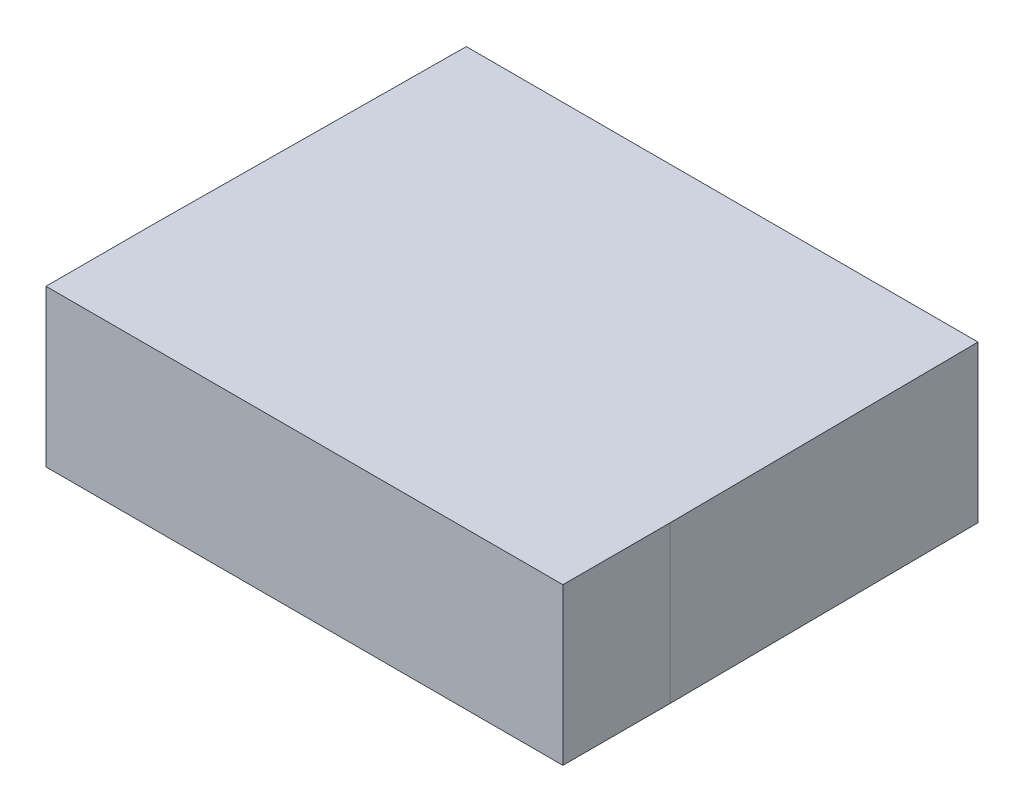
ISO-10303-21;
HEADER;
FILE_DESCRIPTION(('STEP AP214'),'2;1');
FILE_NAME('part.step','',(''),(''),'','','');
FILE_SCHEMA(('AUTOMOTIVE_DESIGN { 1 0 10303 214 1 1 1 1 }'));
ENDSEC;
DATA;
#1=APPLICATION_CONTEXT('core data for automotive mechanical design processes');
#2=APPLICATION_PROTOCOL_DEFINITION('international standard','automotive_design',2000,#1);
#3=PRODUCT_CONTEXT('',#1,'mechanical');
#4=PRODUCT('Part','Part','',(#3));
#5=PRODUCT_RELATED_PRODUCT_CATEGORY('part','',(#4));
#6=PRODUCT_DEFINITION_FORMATION('','',#4);
#7=PRODUCT_DEFINITION_CONTEXT('part definition',#1,'design');
#8=PRODUCT_DEFINITION('design','',#6,#7);
#9=PRODUCT_DEFINITION_SHAPE('','',#8);
#10=(LENGTH_UNIT() NAMED_UNIT(*) SI_UNIT(.MILLI.,.METRE.));
#11=(NAMED_UNIT(*) PLANE_ANGLE_UNIT() SI_UNIT($,.RADIAN.));
#12=(NAMED_UNIT(*) SI_UNIT($,.STERADIAN.) SOLID_ANGLE_UNIT());
#13=UNCERTAINTY_MEASURE_WITH_UNIT(LENGTH_MEASURE(1.E-05),#10,'distance_accuracy_value','');
#14=(GEOMETRIC_REPRESENTATION_CONTEXT(3) GLOBAL_UNCERTAINTY_ASSIGNED_CONTEXT((#13)) GLOBAL_UNIT_ASSIGNED_CONTEXT((#10,
#11,#12)) REPRESENTATION_CONTEXT('',''));
#15=CARTESIAN_POINT('',(0.,0.,0.));
#16=DIRECTION('',(0.,0.,1.));
#17=DIRECTION('',(1.,0.,0.));
#18=AXIS2_PLACEMENT_3D('',#15,#16,#17);
#19=CARTESIAN_POINT('',(-4.95,2.9972,5.95));
#20=DIRECTION('',(0.999964693628954,0.,0.0084030646523441));
#21=DIRECTION('',(0.0084030646523441,0.,-0.999964693628954));
#22=AXIS2_PLACEMENT_3D('',#19,#20,#21);
#23=PLANE('',#22);
#24=DIRECTION('',(-0.0084030646523441,0.,0.999964693628954));
#25=VECTOR('',#24,1.);
#26=CARTESIAN_POINT('',(-4.95,0.,5.95));
#27=LINE('',#26,#25);
#28=CARTESIAN_POINT('',(-4.9,0.,0.));
#29=VERTEX_POINT('',#28);
#30=CARTESIAN_POINT('',(-4.95,0.,5.95));
#31=VERTEX_POINT('',#30);
#32=EDGE_CURVE('E128',#29,#31,#27,.T.);
#33=ORIENTED_EDGE('',*,*,#32,.T.);
#34=DIRECTION('',(0.,-1.,0.));
#35=VECTOR('',#34,1.);
#36=CARTESIAN_POINT('',(-4.95,2.9972,5.95));
#37=LINE('',#36,#35);
#38=CARTESIAN_POINT('',(-4.95,2.9972,5.95));
#39=VERTEX_POINT('',#38);
#40=EDGE_CURVE('E11',#39,#31,#37,.T.);
#41=ORIENTED_EDGE('',*,*,#40,.F.);
#42=DIRECTION('',(-0.0084030646523441,0.,0.999964693628954));
#43=VECTOR('',#42,1.);
#44=CARTESIAN_POINT('',(-4.95,2.9972,5.95));
#45=LINE('',#44,#43);
#46=CARTESIAN_POINT('',(-4.9,2.9972,0.));
#47=VERTEX_POINT('',#46);
#48=EDGE_CURVE('E144',#47,#39,#45,.T.);
#49=ORIENTED_EDGE('',*,*,#48,.F.);
#50=DIRECTION('',(0.,-1.,0.));
#51=VECTOR('',#50,1.);
#52=CARTESIAN_POINT('',(-4.9,2.9972,0.));
#53=LINE('',#52,#51);
#54=EDGE_CURVE('E124',#47,#29,#53,.T.);
#55=ORIENTED_EDGE('',*,*,#54,.T.);
#56=EDGE_LOOP('',(#33,#41,#49,#55));
#57=FACE_BOUND('',#56,.T.);
#58=ADVANCED_FACE('F39',(#57),#23,.F.);
#59=CARTESIAN_POINT('',(-4.95,2.9972,8.));
#60=DIRECTION('',(1.,0.,0.));
#61=DIRECTION('',(0.,0.,-1.));
#62=AXIS2_PLACEMENT_3D('',#59,#60,#61);
#63=PLANE('',#62);
#64=DIRECTION('',(0.,0.,1.));
#65=VECTOR('',#64,1.);
#66=CARTESIAN_POINT('',(-4.95,0.,8.));
#67=LINE('',#66,#65);
#68=CARTESIAN_POINT('',(-4.95,0.,8.));
#69=VERTEX_POINT('',#68);
#70=EDGE_CURVE('E132',#31,#69,#67,.T.);
#71=ORIENTED_EDGE('',*,*,#70,.T.);
#72=DIRECTION('',(0.,-1.,0.));
#73=VECTOR('',#72,1.);
#74=CARTESIAN_POINT('',(-4.95,2.9972,8.));
#75=LINE('',#74,#73);
#76=CARTESIAN_POINT('',(-4.95,2.9972,8.));
#77=VERTEX_POINT('',#76);
#78=EDGE_CURVE('E48',#77,#69,#75,.T.);
#79=ORIENTED_EDGE('',*,*,#78,.F.);
#80=DIRECTION('',(0.,0.,1.));
#81=VECTOR('',#80,1.);
#82=CARTESIAN_POINT('',(-4.95,2.9972,8.));
#83=LINE('',#82,#81);
#84=EDGE_CURVE('E93',#39,#77,#83,.T.);
#85=ORIENTED_EDGE('',*,*,#84,.F.);
#86=ORIENTED_EDGE('',*,*,#40,.T.);
#87=EDGE_LOOP('',(#71,#79,#85,#86));
#88=FACE_BOUND('',#87,.T.);
#89=ADVANCED_FACE('F172',(#88),#63,.F.);
#90=CARTESIAN_POINT('',(4.95,2.9972,8.));
#91=DIRECTION('',(0.,0.,-1.));
#92=DIRECTION('',(-1.,0.,0.));
#93=AXIS2_PLACEMENT_3D('',#90,#91,#92);
#94=PLANE('',#93);
#95=DIRECTION('',(1.,0.,0.));
#96=VECTOR('',#95,1.);
#97=CARTESIAN_POINT('',(4.95,0.,8.));
#98=LINE('',#97,#96);
#99=CARTESIAN_POINT('',(4.95,0.,8.));
#100=VERTEX_POINT('',#99);
#101=EDGE_CURVE('E135',#69,#100,#98,.T.);
#102=ORIENTED_EDGE('',*,*,#101,.T.);
#103=DIRECTION('',(0.,-1.,0.));
#104=VECTOR('',#103,1.);
#105=CARTESIAN_POINT('',(4.95,2.9972,8.));
#106=LINE('',#105,#104);
#107=CARTESIAN_POINT('',(4.95,2.9972,8.));
#108=VERTEX_POINT('',#107);
#109=EDGE_CURVE('E117',#108,#100,#106,.T.);
#110=ORIENTED_EDGE('',*,*,#109,.F.);
#111=DIRECTION('',(1.,0.,0.));
#112=VECTOR('',#111,1.);
#113=CARTESIAN_POINT('',(4.95,2.9972,8.));
#114=LINE('',#113,#112);
#115=EDGE_CURVE('E106',#77,#108,#114,.T.);
#116=ORIENTED_EDGE('',*,*,#115,.F.);
#117=ORIENTED_EDGE('',*,*,#78,.T.);
#118=EDGE_LOOP('',(#102,#110,#116,#117));
#119=FACE_BOUND('',#118,.T.);
#120=ADVANCED_FACE('F154',(#119),#94,.F.);
#121=CARTESIAN_POINT('',(4.95,2.9972,5.95));
#122=DIRECTION('',(-1.,0.,0.));
#123=DIRECTION('',(0.,0.,1.));
#124=AXIS2_PLACEMENT_3D('',#121,#122,#123);
#125=PLANE('',#124);
#126=DIRECTION('',(0.,0.,-1.));
#127=VECTOR('',#126,1.);
#128=CARTESIAN_POINT('',(4.95,0.,5.95));
#129=LINE('',#128,#127);
#130=CARTESIAN_POINT('',(4.95,0.,5.95));
#131=VERTEX_POINT('',#130);
#132=EDGE_CURVE('E115',#100,#131,#129,.T.);
#133=ORIENTED_EDGE('',*,*,#132,.T.);
#134=DIRECTION('',(0.,-1.,0.));
#135=VECTOR('',#134,1.);
#136=CARTESIAN_POINT('',(4.95,2.9972,5.95));
#137=LINE('',#136,#135);
#138=CARTESIAN_POINT('',(4.95,2.9972,5.95));
#139=VERTEX_POINT('',#138);
#140=EDGE_CURVE('E112',#139,#131,#137,.T.);
#141=ORIENTED_EDGE('',*,*,#140,.F.);
#142=DIRECTION('',(0.,0.,-1.));
#143=VECTOR('',#142,1.);
#144=CARTESIAN_POINT('',(4.95,2.9972,5.95));
#145=LINE('',#144,#143);
#146=EDGE_CURVE('E100',#108,#139,#145,.T.);
#147=ORIENTED_EDGE('',*,*,#146,.F.);
#148=ORIENTED_EDGE('',*,*,#109,.T.);
#149=EDGE_LOOP('',(#133,#141,#147,#148));
#150=FACE_BOUND('',#149,.T.);
#151=ADVANCED_FACE('F113',(#150),#125,.F.);
#152=CARTESIAN_POINT('',(4.9,2.9972,0.));
#153=DIRECTION('',(-0.999964693628954,0.,0.0084030646523441));
#154=DIRECTION('',(0.0084030646523441,0.,0.999964693628954));
#155=AXIS2_PLACEMENT_3D('',#152,#153,#154);
#156=PLANE('',#155);
#157=DIRECTION('',(-0.0084030646523441,0.,-0.999964693628954));
#158=VECTOR('',#157,1.);
#159=CARTESIAN_POINT('',(4.9,0.,0.));
#160=LINE('',#159,#158);
#161=CARTESIAN_POINT('',(4.9,0.,0.));
#162=VERTEX_POINT('',#161);
#163=EDGE_CURVE('E79',#131,#162,#160,.T.);
#164=ORIENTED_EDGE('',*,*,#163,.T.);
#165=DIRECTION('',(0.,-1.,0.));
#166=VECTOR('',#165,1.);
#167=CARTESIAN_POINT('',(4.9,2.9972,0.));
#168=LINE('',#167,#166);
#169=CARTESIAN_POINT('',(4.9,2.9972,0.));
#170=VERTEX_POINT('',#169);
#171=EDGE_CURVE('E118',#170,#162,#168,.T.);
#172=ORIENTED_EDGE('',*,*,#171,.F.);
#173=DIRECTION('',(-0.0084030646523441,0.,-0.999964693628954));
#174=VECTOR('',#173,1.);
#175=CARTESIAN_POINT('',(4.9,2.9972,0.));
#176=LINE('',#175,#174);
#177=EDGE_CURVE('E104',#139,#170,#176,.T.);
#178=ORIENTED_EDGE('',*,*,#177,.F.);
#179=ORIENTED_EDGE('',*,*,#140,.T.);
#180=EDGE_LOOP('',(#164,#172,#178,#179));
#181=FACE_BOUND('',#180,.T.);
#182=ADVANCED_FACE('F120',(#181),#156,.F.);
#183=CARTESIAN_POINT('',(-4.9,2.9972,0.));
#184=DIRECTION('',(0.,0.,1.));
#185=DIRECTION('',(1.,0.,0.));
#186=AXIS2_PLACEMENT_3D('',#183,#184,#185);
#187=PLANE('',#186);
#188=DIRECTION('',(-1.,0.,0.));
#189=VECTOR('',#188,1.);
#190=CARTESIAN_POINT('',(-4.9,0.,0.));
#191=LINE('',#190,#189);
#192=EDGE_CURVE('E85',#162,#29,#191,.T.);
#193=ORIENTED_EDGE('',*,*,#192,.T.);
#194=ORIENTED_EDGE('',*,*,#54,.F.);
#195=DIRECTION('',(-1.,0.,0.));
#196=VECTOR('',#195,1.);
#197=CARTESIAN_POINT('',(-4.9,2.9972,0.));
#198=LINE('',#197,#196);
#199=EDGE_CURVE('E56',#170,#47,#198,.T.);
#200=ORIENTED_EDGE('',*,*,#199,.F.);
#201=ORIENTED_EDGE('',*,*,#171,.T.);
#202=EDGE_LOOP('',(#193,#194,#200,#201));
#203=FACE_BOUND('',#202,.T.);
#204=ADVANCED_FACE('F161',(#203),#187,.F.);
#205=CARTESIAN_POINT('',(0.,2.9972,0.));
#206=DIRECTION('',(0.,-1.,0.));
#207=DIRECTION('',(0.,0.,-1.));
#208=AXIS2_PLACEMENT_3D('',#205,#206,#207);
#209=PLANE('',#208);
#210=ORIENTED_EDGE('',*,*,#48,.T.);
#211=ORIENTED_EDGE('',*,*,#84,.T.);
#212=ORIENTED_EDGE('',*,*,#115,.T.);
#213=ORIENTED_EDGE('',*,*,#146,.T.);
#214=ORIENTED_EDGE('',*,*,#177,.T.);
#215=ORIENTED_EDGE('',*,*,#199,.T.);
#216=EDGE_LOOP('',(#210,#211,#212,#213,#214,#215));
#217=FACE_BOUND('',#216,.T.);
#218=ADVANCED_FACE('F102',(#217),#209,.F.);
#219=CARTESIAN_POINT('',(0.,0.,0.));
#220=DIRECTION('',(0.,-1.,0.));
#221=DIRECTION('',(0.,0.,-1.));
#222=AXIS2_PLACEMENT_3D('',#219,#220,#221);
#223=PLANE('',#222);
#224=ORIENTED_EDGE('',*,*,#32,.F.);
#225=ORIENTED_EDGE('',*,*,#192,.F.);
#226=ORIENTED_EDGE('',*,*,#163,.F.);
#227=ORIENTED_EDGE('',*,*,#132,.F.);
#228=ORIENTED_EDGE('',*,*,#101,.F.);
#229=ORIENTED_EDGE('',*,*,#70,.F.);
#230=EDGE_LOOP('',(#224,#225,#226,#227,#228,#229));
#231=FACE_BOUND('',#230,.T.);
#232=ADVANCED_FACE('F157',(#231),#223,.T.);
#233=CLOSED_SHELL('',(#58,#89,#120,#151,#182,#204,#218,#232));
#234=MANIFOLD_SOLID_BREP('B2',#233);
#235=ADVANCED_BREP_SHAPE_REPRESENTATION('',(#18,#234),#14);
#236=SHAPE_DEFINITION_REPRESENTATION(#9,#235);
ENDSEC;
END-ISO-10303-21;
